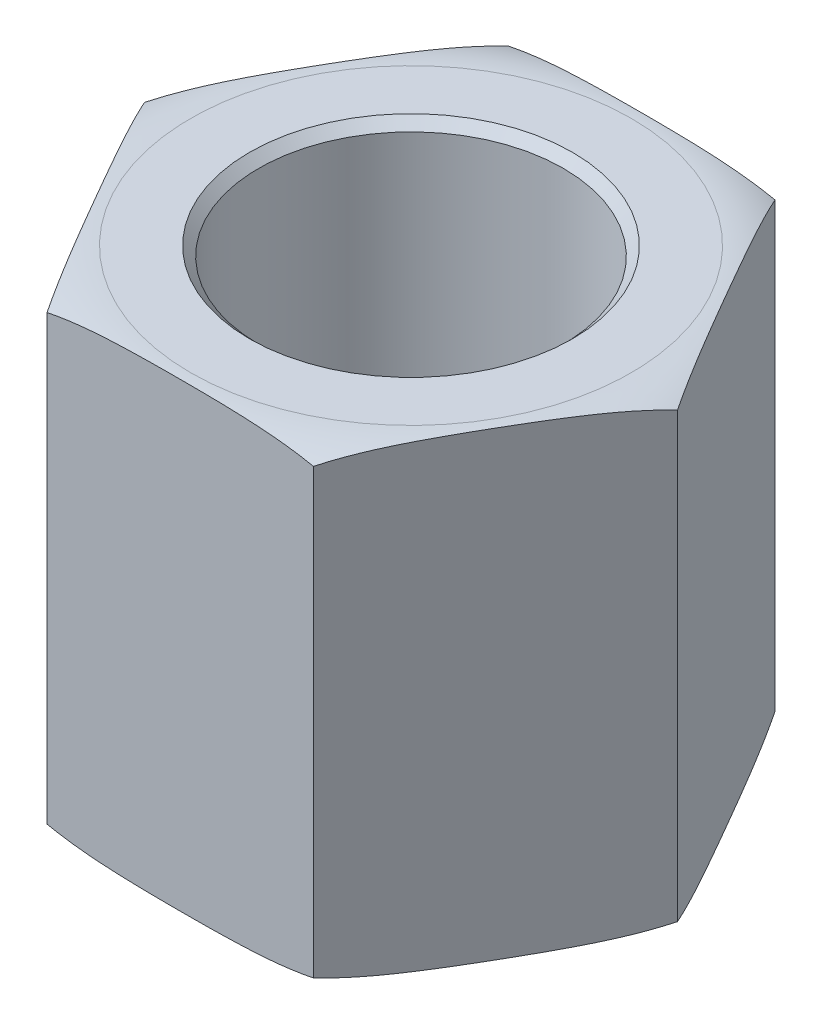
ISO-10303-21;
HEADER;
FILE_DESCRIPTION(('STEP AP214'),'2;1');
FILE_NAME('part.step','',(''),(''),'','','');
FILE_SCHEMA(('AUTOMOTIVE_DESIGN { 1 0 10303 214 1 1 1 1 }'));
ENDSEC;
DATA;
#1=APPLICATION_CONTEXT('core data for automotive mechanical design processes');
#2=APPLICATION_PROTOCOL_DEFINITION('international standard','automotive_design',2000,#1);
#3=PRODUCT_CONTEXT('',#1,'mechanical');
#4=PRODUCT('Part','Part','',(#3));
#5=PRODUCT_RELATED_PRODUCT_CATEGORY('part','',(#4));
#6=PRODUCT_DEFINITION_FORMATION('','',#4);
#7=PRODUCT_DEFINITION_CONTEXT('part definition',#1,'design');
#8=PRODUCT_DEFINITION('design','',#6,#7);
#9=PRODUCT_DEFINITION_SHAPE('','',#8);
#10=(LENGTH_UNIT() NAMED_UNIT(*) SI_UNIT(.MILLI.,.METRE.));
#11=(NAMED_UNIT(*) PLANE_ANGLE_UNIT() SI_UNIT($,.RADIAN.));
#12=(NAMED_UNIT(*) SI_UNIT($,.STERADIAN.) SOLID_ANGLE_UNIT());
#13=UNCERTAINTY_MEASURE_WITH_UNIT(LENGTH_MEASURE(1.E-05),#10,'distance_accuracy_value','');
#14=(GEOMETRIC_REPRESENTATION_CONTEXT(3) GLOBAL_UNCERTAINTY_ASSIGNED_CONTEXT((#13)) GLOBAL_UNIT_ASSIGNED_CONTEXT((#10,
#11,#12)) REPRESENTATION_CONTEXT('',''));
#15=CARTESIAN_POINT('',(0.,0.,0.));
#16=DIRECTION('',(0.,0.,1.));
#17=DIRECTION('',(1.,0.,0.));
#18=AXIS2_PLACEMENT_3D('',#15,#16,#17);
#19=CARTESIAN_POINT('',(3.66617420935412,3.175,0.));
#20=DIRECTION('',(-0.866025403784439,0.,0.5));
#21=DIRECTION('',(0.5,0.,0.866025403784439));
#22=AXIS2_PLACEMENT_3D('',#19,#20,#21);
#23=PLANE('',#22);
#24=DIRECTION('',(0.,1.,0.));
#25=VECTOR('',#24,1.);
#26=CARTESIAN_POINT('',(1.83308710467704,3.175,-3.175));
#27=LINE('',#26,#25);
#28=CARTESIAN_POINT('',(1.83308710467705,-3.048,-3.175));
#29=VERTEX_POINT('',#28);
#30=CARTESIAN_POINT('',(1.83308710467706,3.048,-3.175));
#31=VERTEX_POINT('',#30);
#32=EDGE_CURVE('E300',#29,#31,#27,.T.);
#33=ORIENTED_EDGE('',*,*,#32,.T.);
#34=CARTESIAN_POINT('',(3.66617420935412,3.048,0.));
#35=CARTESIAN_POINT('',(3.62797961467394,3.06390141489968,-0.0661549785605589));
#36=CARTESIAN_POINT('',(3.58956810864156,3.0774886076105,-0.132685658603879));
#37=CARTESIAN_POINT('',(3.5124905179571,3.10081619794021,-0.266187961794368));
#38=CARTESIAN_POINT('',(3.47382473049846,3.11056047713974,-0.333159070187402));
#39=CARTESIAN_POINT('',(3.39641631867872,3.1269966530451,-0.467234372392398));
#40=CARTESIAN_POINT('',(3.35767399633311,3.13369453286691,-0.534338043098204));
#41=CARTESIAN_POINT('',(3.28009834620112,3.1447767572932,-0.668703010557007));
#42=CARTESIAN_POINT('',(3.24126499587769,3.14916045047396,-0.735964346345296));
#43=CARTESIAN_POINT('',(3.16354065964313,3.15624030042628,-0.870586845688132));
#44=CARTESIAN_POINT('',(3.12464965374474,3.15893552375912,-0.937948043861606));
#45=CARTESIAN_POINT('',(3.0468514459459,3.16315319837134,-1.07269849250699));
#46=CARTESIAN_POINT('',(3.00794424351967,3.16467560802717,-1.1400877438896));
#47=CARTESIAN_POINT('',(2.9305151759887,3.16692270588903,-1.27419882283591));
#48=CARTESIAN_POINT('',(2.89199336248931,3.16765524681808,-1.34092056101654));
#49=CARTESIAN_POINT('',(2.8149477834614,3.16857673025741,-1.47436741839145));
#50=CARTESIAN_POINT('',(2.77642401791435,3.1687656658949,-1.54109253761781));
#51=CARTESIAN_POINT('',(2.69935964431008,3.16866599668056,-1.67457194815387));
#52=CARTESIAN_POINT('',(2.66081903631817,3.16837718117656,-1.74132623935046));
#53=CARTESIAN_POINT('',(2.58373908085325,3.167221986219,-1.87483263846085));
#54=CARTESIAN_POINT('',(2.5451997334124,3.16635559703857,-1.94158474631894));
#55=CARTESIAN_POINT('',(2.46812969629766,3.16378619406563,-2.07507396634291));
#56=CARTESIAN_POINT('',(2.4295990062596,3.16208322716165,-2.14181107913951));
#57=CARTESIAN_POINT('',(2.35255651340903,3.1574387229726,-2.27525259109846));
#58=CARTESIAN_POINT('',(2.31404470975437,3.1544972471358,-2.34195699171945));
#59=CARTESIAN_POINT('',(2.25084206239939,3.14821741247488,-2.45142718811113));
#60=CARTESIAN_POINT('',(2.22613849337005,3.14539801104631,-2.49421502479824));
#61=CARTESIAN_POINT('',(2.17676945272223,3.13886967943036,-2.57972471152119));
#62=CARTESIAN_POINT('',(2.15210397034179,3.1351610809139,-2.62244658019731));
#63=CARTESIAN_POINT('',(2.10282753811692,3.12668027114969,-2.7077958644265));
#64=CARTESIAN_POINT('',(2.07821657107525,3.12190846570084,-2.75042330976607));
#65=CARTESIAN_POINT('',(2.02900094683547,3.11109877125159,-2.8356672714756));
#66=CARTESIAN_POINT('',(2.00439646085461,3.10505773130842,-2.87828349128857));
#67=CARTESIAN_POINT('',(1.95527325900931,3.09151383541611,-2.96336737271508));
#68=CARTESIAN_POINT('',(1.93075459617612,3.08401019780296,-3.00583494247581));
#69=CARTESIAN_POINT('',(1.8818215737317,3.06732035070844,-3.09058942351746));
#70=CARTESIAN_POINT('',(1.85740744053269,3.05813149780328,-3.13287594264091));
#71=CARTESIAN_POINT('',(1.83308710467706,3.048,-3.175));
#72=B_SPLINE_CURVE_WITH_KNOTS('',3,(#34,#35,#36,#37,#38,#39,#40,#41,#42,#43,#44,#45,#46,#47,#48,
#49,#50,#51,#52,#53,#54,#55,#56,#57,#58,#59,#60,#61,#62,#63,#64,#65,#66,#67,#68,#69,#70,#71),
.UNSPECIFIED.,.F.,.F.,(4,2,2,2,2,2,2,2,2,2,2,2,2,2,2,2,2,2,4),(0.,0.23397730781795,
0.467717675040711,0.700996973557526,0.934341903229784,1.16781571967244,1.4012978217983,
1.63243665809676,1.86357841666624,2.09482211846302,2.32606971471504,2.55730435147407,
2.78852751694423,2.93698369265096,3.08538458004481,3.2337289233459,3.38244598546617,
3.53124274626086,3.68027493713586),.UNSPECIFIED.);
#73=CARTESIAN_POINT('',(3.66617420935412,3.048,0.));
#74=VERTEX_POINT('',#73);
#75=EDGE_CURVE('E94',#74,#31,#72,.T.);
#76=ORIENTED_EDGE('',*,*,#75,.F.);
#77=DIRECTION('',(0.,1.,0.));
#78=VECTOR('',#77,1.);
#79=CARTESIAN_POINT('',(3.66617420935412,3.175,0.));
#80=LINE('',#79,#78);
#81=CARTESIAN_POINT('',(3.66617420935412,-3.048,0.));
#82=VERTEX_POINT('',#81);
#83=EDGE_CURVE('E297',#74,#82,#80,.F.);
#84=ORIENTED_EDGE('',*,*,#83,.T.);
#85=CARTESIAN_POINT('',(1.83308710467705,-3.048,-3.17500000000001));
#86=CARTESIAN_POINT('',(1.87128169935723,-3.06390141489968,-3.10884502143945));
#87=CARTESIAN_POINT('',(1.9096932053896,-3.0774886076105,-3.04231434139613));
#88=CARTESIAN_POINT('',(1.98677079607407,-3.1008161979402,-2.90881203820564));
#89=CARTESIAN_POINT('',(2.02543658353271,-3.11056047713974,-2.84184092981261));
#90=CARTESIAN_POINT('',(2.10284499535245,-3.12699665304509,-2.70776562760762));
#91=CARTESIAN_POINT('',(2.14158731769805,-3.13369453286691,-2.64066195690181));
#92=CARTESIAN_POINT('',(2.21916296783005,-3.14477675729319,-2.50629698944301));
#93=CARTESIAN_POINT('',(2.25799631815347,-3.14916045047396,-2.43903565365472));
#94=CARTESIAN_POINT('',(2.33572065438803,-3.15624030042628,-2.30441315431189));
#95=CARTESIAN_POINT('',(2.37461166028642,-3.15893552375912,-2.23705195613842));
#96=CARTESIAN_POINT('',(2.45240986808526,-3.16315319837134,-2.10230150749304));
#97=CARTESIAN_POINT('',(2.49131707051149,-3.16467560802717,-2.03491225611043));
#98=CARTESIAN_POINT('',(2.56874613804246,-3.16692270588903,-1.90080117716412));
#99=CARTESIAN_POINT('',(2.60726795154184,-3.16765524681808,-1.83407943898349));
#100=CARTESIAN_POINT('',(2.68431353056976,-3.16857673025742,-1.70063258160858));
#101=CARTESIAN_POINT('',(2.7228372961168,-3.1687656658949,-1.63390746238223));
#102=CARTESIAN_POINT('',(2.79990166972107,-3.16866599668056,-1.50042805184616));
#103=CARTESIAN_POINT('',(2.83844227771298,-3.16837718117656,-1.43367376064958));
#104=CARTESIAN_POINT('',(2.9155222331779,-3.167221986219,-1.30016736153919));
#105=CARTESIAN_POINT('',(2.95406158061874,-3.16635559703857,-1.2334152536811));
#106=CARTESIAN_POINT('',(3.03113161773349,-3.16378619406563,-1.09992603365714));
#107=CARTESIAN_POINT('',(3.06966230777155,-3.16208322716165,-1.03318892086054));
#108=CARTESIAN_POINT('',(3.14670480062212,-3.15743872297261,-0.89974740890159));
#109=CARTESIAN_POINT('',(3.18521660427678,-3.1544972471358,-0.833043008280603));
#110=CARTESIAN_POINT('',(3.24841925163175,-3.14821741247488,-0.723572811888921));
#111=CARTESIAN_POINT('',(3.2731228206611,-3.14539801104632,-0.680784975201808));
#112=CARTESIAN_POINT('',(3.32249186130892,-3.13886967943036,-0.595275288478853));
#113=CARTESIAN_POINT('',(3.34715734368936,-3.1351610809139,-0.552553419802732));
#114=CARTESIAN_POINT('',(3.39643377591423,-3.12668027114969,-0.467204135573528));
#115=CARTESIAN_POINT('',(3.4210447429559,-3.12190846570084,-0.424576690233956));
#116=CARTESIAN_POINT('',(3.47026036719569,-3.11109877125159,-0.339332728524421));
#117=CARTESIAN_POINT('',(3.49486485317655,-3.10505773130842,-0.296716508711452));
#118=CARTESIAN_POINT('',(3.54398805502185,-3.09151383541612,-0.211632627284937));
#119=CARTESIAN_POINT('',(3.56850671785504,-3.08401019780296,-0.169165057524198));
#120=CARTESIAN_POINT('',(3.61743974029947,-3.06732035070844,-0.0844105764825437));
#121=CARTESIAN_POINT('',(3.64185387349848,-3.05813149780329,-0.0421240573590973));
#122=CARTESIAN_POINT('',(3.66617420935412,-3.048,0.));
#123=B_SPLINE_CURVE_WITH_KNOTS('',3,(#85,#86,#87,#88,#89,#90,#91,#92,#93,#94,#95,#96,#97,#98,
#99,#100,#101,#102,#103,#104,#105,#106,#107,#108,#109,#110,#111,#112,#113,#114,#115,#116,#117,
#118,#119,#120,#121,#122),.UNSPECIFIED.,.F.,.F.,(4,2,2,2,2,2,2,2,2,2,2,2,2,2,2,2,2,2,4),(0.,
0.233977307817946,0.467717675040702,0.700996973557513,0.934341903229767,1.16781571967242,
1.40129782179827,1.63243665809673,1.8635784166662,2.09482211846298,2.32606971471499,
2.55730435147402,2.78852751694418,2.93698369265092,3.08538458004477,3.23372892334588,
3.38244598546615,3.53124274626086,3.68027493713586),.UNSPECIFIED.);
#124=EDGE_CURVE('E143',#29,#82,#123,.T.);
#125=ORIENTED_EDGE('',*,*,#124,.F.);
#126=EDGE_LOOP('',(#33,#76,#84,#125));
#127=FACE_BOUND('',#126,.T.);
#128=ADVANCED_FACE('F14',(#127),#23,.F.);
#129=CARTESIAN_POINT('',(1.83308710467706,3.175,3.17499999999999));
#130=DIRECTION('',(-0.866025403784439,0.,-0.5));
#131=DIRECTION('',(-0.5,0.,0.866025403784439));
#132=AXIS2_PLACEMENT_3D('',#129,#130,#131);
#133=PLANE('',#132);
#134=ORIENTED_EDGE('',*,*,#83,.F.);
#135=CARTESIAN_POINT('',(1.83308710467706,3.048,3.17499999999999));
#136=CARTESIAN_POINT('',(1.87128169935724,3.06390141489968,3.10884502143943));
#137=CARTESIAN_POINT('',(1.90969320538962,3.0774886076105,3.04231434139611));
#138=CARTESIAN_POINT('',(1.98677079607408,3.10081619794021,2.90881203820562));
#139=CARTESIAN_POINT('',(2.02543658353273,3.11056047713974,2.84184092981259));
#140=CARTESIAN_POINT('',(2.10284499535246,3.1269966530451,2.70776562760759));
#141=CARTESIAN_POINT('',(2.14158731769807,3.13369453286691,2.64066195690179));
#142=CARTESIAN_POINT('',(2.21916296783006,3.1447767572932,2.50629698944298));
#143=CARTESIAN_POINT('',(2.25799631815349,3.14916045047396,2.43903565365469));
#144=CARTESIAN_POINT('',(2.33572065438805,3.15624030042628,2.30441315431186));
#145=CARTESIAN_POINT('',(2.37461166028644,3.15893552375912,2.23705195613839));
#146=CARTESIAN_POINT('',(2.45240986808528,3.16315319837134,2.102301507493));
#147=CARTESIAN_POINT('',(2.49131707051152,3.16467560802717,2.03491225611039));
#148=CARTESIAN_POINT('',(2.56874613804248,3.16692270588903,1.90080117716408));
#149=CARTESIAN_POINT('',(2.60726795154187,3.16765524681808,1.83407943898345));
#150=CARTESIAN_POINT('',(2.68431353056978,3.16857673025741,1.70063258160854));
#151=CARTESIAN_POINT('',(2.72283729611683,3.1687656658949,1.63390746238219));
#152=CARTESIAN_POINT('',(2.7999016697211,3.16866599668056,1.50042805184612));
#153=CARTESIAN_POINT('',(2.83844227771301,3.16837718117656,1.43367376064953));
#154=CARTESIAN_POINT('',(2.91552223317793,3.167221986219,1.30016736153914));
#155=CARTESIAN_POINT('',(2.95406158061878,3.16635559703857,1.23341525368105));
#156=CARTESIAN_POINT('',(3.03113161773353,3.16378619406563,1.09992603365708));
#157=CARTESIAN_POINT('',(3.06966230777158,3.16208322716165,1.03318892086048));
#158=CARTESIAN_POINT('',(3.14670480062215,3.1574387229726,0.899747408901533));
#159=CARTESIAN_POINT('',(3.18521660427681,3.1544972471358,0.833043008280545));
#160=CARTESIAN_POINT('',(3.24841925163179,3.14821741247488,0.723572811888865));
#161=CARTESIAN_POINT('',(3.27312282066113,3.14539801104631,0.680784975201756));
#162=CARTESIAN_POINT('',(3.32249186130895,3.13886967943036,0.595275288478808));
#163=CARTESIAN_POINT('',(3.34715734368939,3.1351610809139,0.55255341980269));
#164=CARTESIAN_POINT('',(3.39643377591426,3.12668027114969,0.467204135573494));
#165=CARTESIAN_POINT('',(3.42104474295592,3.12190846570084,0.424576690233925));
#166=CARTESIAN_POINT('',(3.47026036719571,3.11109877125159,0.339332728524397));
#167=CARTESIAN_POINT('',(3.49486485317657,3.10505773130842,0.296716508711432));
#168=CARTESIAN_POINT('',(3.54398805502186,3.09151383541612,0.211632627284924));
#169=CARTESIAN_POINT('',(3.56850671785505,3.08401019780296,0.169165057524189));
#170=CARTESIAN_POINT('',(3.61743974029947,3.06732035070844,0.0844105764825421));
#171=CARTESIAN_POINT('',(3.64185387349848,3.05813149780328,0.0421240573590994));
#172=CARTESIAN_POINT('',(3.66617420935412,3.048,0.));
#173=B_SPLINE_CURVE_WITH_KNOTS('',3,(#135,#136,#137,#138,#139,#140,#141,#142,#143,#144,#145,
#146,#147,#148,#149,#150,#151,#152,#153,#154,#155,#156,#157,#158,#159,#160,#161,#162,#163,#164,
#165,#166,#167,#168,#169,#170,#171,#172),.UNSPECIFIED.,.F.,.F.,(4,2,2,2,2,2,2,2,2,2,2,2,2,2,2,2,
2,2,4),(0.,0.23397730781795,0.467717675040712,0.700996973557526,0.934341903229785,
1.16781571967244,1.4012978217983,1.63243665809676,1.86357841666624,2.09482211846302,
2.32606971471504,2.55730435147407,2.78852751694424,2.93698369265096,3.0853845800448,
3.23372892334589,3.38244598546615,3.53124274626085,3.68027493713584),.UNSPECIFIED.);
#174=CARTESIAN_POINT('',(1.83308710467706,3.048,3.17499999999999));
#175=VERTEX_POINT('',#174);
#176=EDGE_CURVE('E171',#175,#74,#173,.T.);
#177=ORIENTED_EDGE('',*,*,#176,.F.);
#178=DIRECTION('',(0.,1.,0.));
#179=VECTOR('',#178,1.);
#180=CARTESIAN_POINT('',(1.83308710467706,3.175,3.17499999999999));
#181=LINE('',#180,#179);
#182=CARTESIAN_POINT('',(1.83308710467706,-3.048,3.17499999999999));
#183=VERTEX_POINT('',#182);
#184=EDGE_CURVE('E295',#175,#183,#181,.F.);
#185=ORIENTED_EDGE('',*,*,#184,.T.);
#186=CARTESIAN_POINT('',(3.66617420935412,-3.048,0.));
#187=CARTESIAN_POINT('',(3.62797961467394,-3.06390141489968,0.0661549785605642));
#188=CARTESIAN_POINT('',(3.58956810864156,-3.0774886076105,0.132685658603884));
#189=CARTESIAN_POINT('',(3.5124905179571,-3.10081619794021,0.266187961794373));
#190=CARTESIAN_POINT('',(3.47382473049845,-3.11056047713974,0.333159070187407));
#191=CARTESIAN_POINT('',(3.39641631867872,-3.1269966530451,0.467234372392404));
#192=CARTESIAN_POINT('',(3.35767399633311,-3.13369453286691,0.53433804309821));
#193=CARTESIAN_POINT('',(3.28009834620112,-3.1447767572932,0.668703010557013));
#194=CARTESIAN_POINT('',(3.24126499587769,-3.14916045047396,0.735964346345303));
#195=CARTESIAN_POINT('',(3.16354065964313,-3.15624030042628,0.870586845688138));
#196=CARTESIAN_POINT('',(3.12464965374474,-3.15893552375912,0.937948043861613));
#197=CARTESIAN_POINT('',(3.0468514459459,-3.16315319837134,1.07269849250699));
#198=CARTESIAN_POINT('',(3.00794424351966,-3.16467560802717,1.1400877438896));
#199=CARTESIAN_POINT('',(2.9305151759887,-3.16692270588903,1.27419882283592));
#200=CARTESIAN_POINT('',(2.89199336248931,-3.16765524681808,1.34092056101655));
#201=CARTESIAN_POINT('',(2.8149477834614,-3.16857673025741,1.47436741839146));
#202=CARTESIAN_POINT('',(2.77642401791435,-3.1687656658949,1.54109253761781));
#203=CARTESIAN_POINT('',(2.69935964431008,-3.16866599668056,1.67457194815388));
#204=CARTESIAN_POINT('',(2.66081903631817,-3.16837718117656,1.74132623935047));
#205=CARTESIAN_POINT('',(2.58373908085325,-3.167221986219,1.87483263846085));
#206=CARTESIAN_POINT('',(2.5451997334124,-3.16635559703857,1.94158474631895));
#207=CARTESIAN_POINT('',(2.46812969629765,-3.16378619406563,2.07507396634292));
#208=CARTESIAN_POINT('',(2.4295990062596,-3.16208322716165,2.14181107913952));
#209=CARTESIAN_POINT('',(2.35255651340903,-3.1574387229726,2.27525259109847));
#210=CARTESIAN_POINT('',(2.31404470975437,-3.1544972471358,2.34195699171945));
#211=CARTESIAN_POINT('',(2.25084206239939,-3.14821741247488,2.45142718811113));
#212=CARTESIAN_POINT('',(2.22613849337005,-3.14539801104631,2.49421502479824));
#213=CARTESIAN_POINT('',(2.17676945272223,-3.13886967943036,2.57972471152119));
#214=CARTESIAN_POINT('',(2.15210397034179,-3.1351610809139,2.62244658019731));
#215=CARTESIAN_POINT('',(2.10282753811692,-3.12668027114969,2.7077958644265));
#216=CARTESIAN_POINT('',(2.07821657107526,-3.12190846570084,2.75042330976607));
#217=CARTESIAN_POINT('',(2.02900094683547,-3.11109877125159,2.8356672714756));
#218=CARTESIAN_POINT('',(2.00439646085461,-3.10505773130842,2.87828349128856));
#219=CARTESIAN_POINT('',(1.95527325900932,-3.09151383541611,2.96336737271507));
#220=CARTESIAN_POINT('',(1.93075459617613,-3.08401019780296,3.00583494247581));
#221=CARTESIAN_POINT('',(1.88182157373171,-3.06732035070844,3.09058942351745));
#222=CARTESIAN_POINT('',(1.8574074405327,-3.05813149780328,3.1328759426409));
#223=CARTESIAN_POINT('',(1.83308710467706,-3.048,3.17499999999999));
#224=B_SPLINE_CURVE_WITH_KNOTS('',3,(#186,#187,#188,#189,#190,#191,#192,#193,#194,#195,#196,
#197,#198,#199,#200,#201,#202,#203,#204,#205,#206,#207,#208,#209,#210,#211,#212,#213,#214,#215,
#216,#217,#218,#219,#220,#221,#222,#223),.UNSPECIFIED.,.F.,.F.,(4,2,2,2,2,2,2,2,2,2,2,2,2,2,2,2,
2,2,4),(0.,0.23397730781795,0.467717675040712,0.700996973557527,0.934341903229786,
1.16781571967244,1.4012978217983,1.63243665809676,1.86357841666624,2.09482211846302,
2.32606971471504,2.55730435147408,2.78852751694424,2.93698369265096,3.0853845800448,
3.23372892334589,3.38244598546615,3.53124274626085,3.68027493713584),.UNSPECIFIED.);
#225=EDGE_CURVE('E150',#82,#183,#224,.T.);
#226=ORIENTED_EDGE('',*,*,#225,.F.);
#227=EDGE_LOOP('',(#134,#177,#185,#226));
#228=FACE_BOUND('',#227,.T.);
#229=ADVANCED_FACE('F162',(#228),#133,.F.);
#230=CARTESIAN_POINT('',(1.83308710467706,3.175,-3.175));
#231=DIRECTION('',(0.,0.,1.));
#232=DIRECTION('',(1.,0.,0.));
#233=AXIS2_PLACEMENT_3D('',#230,#231,#232);
#234=PLANE('',#233);
#235=DIRECTION('',(0.,1.,0.));
#236=VECTOR('',#235,1.);
#237=CARTESIAN_POINT('',(-1.83308710467707,3.175,-3.175));
#238=LINE('',#237,#236);
#239=CARTESIAN_POINT('',(-1.83308710467707,-3.048,-3.175));
#240=VERTEX_POINT('',#239);
#241=CARTESIAN_POINT('',(-1.83308710467706,3.048,-3.17500000000001));
#242=VERTEX_POINT('',#241);
#243=EDGE_CURVE('E101',#240,#242,#238,.T.);
#244=ORIENTED_EDGE('',*,*,#243,.T.);
#245=CARTESIAN_POINT('',(1.83308710467705,3.048,-3.175));
#246=CARTESIAN_POINT('',(1.73237579828683,3.06894001415179,-3.175));
#247=CARTESIAN_POINT('',(1.63096506893486,3.08588534953273,-3.175));
#248=CARTESIAN_POINT('',(1.42767146651469,3.11349716439842,-3.175));
#249=CARTESIAN_POINT('',(1.32579191427254,3.12418756587531,-3.175));
#250=CARTESIAN_POINT('',(1.12177634709137,3.14112804080793,-3.175));
#251=CARTESIAN_POINT('',(1.01964056643379,3.14738127071887,-3.175));
#252=CARTESIAN_POINT('',(0.815663681397375,3.15690280641833,-3.175));
#253=CARTESIAN_POINT('',(0.713823115514572,3.1601834044999,-3.175));
#254=CARTESIAN_POINT('',(0.51001848544165,3.16494548487028,-3.175));
#255=CARTESIAN_POINT('',(0.408054390577976,3.16642541008817,-3.175));
#256=CARTESIAN_POINT('',(0.20406020033787,3.16831468183792,-3.175));
#257=CARTESIAN_POINT('',(0.102030100168935,3.16872342414921,-3.175));
#258=CARTESIAN_POINT('',(-0.102030100168934,3.16872342414921,-3.175));
#259=CARTESIAN_POINT('',(-0.204060200337869,3.16831468183792,-3.175));
#260=CARTESIAN_POINT('',(-0.408054390577974,3.16642541008817,-3.175));
#261=CARTESIAN_POINT('',(-0.510018485441648,3.16494548487028,-3.175));
#262=CARTESIAN_POINT('',(-0.71382311551457,3.1601834044999,-3.175));
#263=CARTESIAN_POINT('',(-0.815663681397372,3.15690280641833,-3.175));
#264=CARTESIAN_POINT('',(-1.01964056643379,3.14738127071887,-3.175));
#265=CARTESIAN_POINT('',(-1.12177634709137,3.14112804080793,-3.175));
#266=CARTESIAN_POINT('',(-1.32579191427253,3.12418756587531,-3.175));
#267=CARTESIAN_POINT('',(-1.42767146651468,3.11349716439842,-3.175));
#268=CARTESIAN_POINT('',(-1.63096506893485,3.08588534953273,-3.175));
#269=CARTESIAN_POINT('',(-1.73237579828682,3.06894001415179,-3.175));
#270=CARTESIAN_POINT('',(-1.83308710467705,3.048,-3.175));
#271=B_SPLINE_CURVE_WITH_KNOTS('',3,(#245,#246,#247,#248,#249,#250,#251,#252,#253,#254,#255,
#256,#257,#258,#259,#260,#261,#262,#263,#264,#265,#266,#267,#268,#269,#270),.UNSPECIFIED.,.F.,
.F.,(4,2,2,2,2,2,2,2,2,2,2,2,4),(0.,0.308333242342807,0.615479423308234,0.922406891130007,
1.2280592962085,1.53397581645216,1.84006485747888,2.14615389850561,2.45207041874927,
2.75772282382776,3.06465029164953,3.37179647261496,3.68012971495776),.UNSPECIFIED.);
#272=EDGE_CURVE('E86',#31,#242,#271,.T.);
#273=ORIENTED_EDGE('',*,*,#272,.F.);
#274=ORIENTED_EDGE('',*,*,#32,.F.);
#275=CARTESIAN_POINT('',(-1.83308710467707,-3.048,-3.175));
#276=CARTESIAN_POINT('',(-1.73237579828684,-3.06894001415179,-3.175));
#277=CARTESIAN_POINT('',(-1.63096506893487,-3.08588534953273,-3.175));
#278=CARTESIAN_POINT('',(-1.4276714665147,-3.11349716439842,-3.175));
#279=CARTESIAN_POINT('',(-1.32579191427255,-3.12418756587531,-3.175));
#280=CARTESIAN_POINT('',(-1.12177634709138,-3.14112804080793,-3.175));
#281=CARTESIAN_POINT('',(-1.0196405664338,-3.14738127071887,-3.175));
#282=CARTESIAN_POINT('',(-0.81566368139738,-3.15690280641833,-3.175));
#283=CARTESIAN_POINT('',(-0.713823115514576,-3.1601834044999,-3.175));
#284=CARTESIAN_POINT('',(-0.510018485441653,-3.16494548487028,-3.175));
#285=CARTESIAN_POINT('',(-0.408054390577979,-3.16642541008817,-3.175));
#286=CARTESIAN_POINT('',(-0.204060200337872,-3.16831468183792,-3.175));
#287=CARTESIAN_POINT('',(-0.102030100168936,-3.16872342414921,-3.175));
#288=CARTESIAN_POINT('',(0.102030100168934,-3.16872342414921,-3.175));
#289=CARTESIAN_POINT('',(0.204060200337869,-3.16831468183792,-3.175));
#290=CARTESIAN_POINT('',(0.408054390577974,-3.16642541008817,-3.175));
#291=CARTESIAN_POINT('',(0.510018485441648,-3.16494548487028,-3.175));
#292=CARTESIAN_POINT('',(0.713823115514568,-3.1601834044999,-3.175));
#293=CARTESIAN_POINT('',(0.81566368139737,-3.15690280641833,-3.175));
#294=CARTESIAN_POINT('',(1.01964056643379,-3.14738127071887,-3.175));
#295=CARTESIAN_POINT('',(1.12177634709137,-3.14112804080793,-3.175));
#296=CARTESIAN_POINT('',(1.32579191427253,-3.12418756587531,-3.175));
#297=CARTESIAN_POINT('',(1.42767146651468,-3.11349716439842,-3.175));
#298=CARTESIAN_POINT('',(1.63096506893485,-3.08588534953273,-3.175));
#299=CARTESIAN_POINT('',(1.73237579828682,-3.06894001415179,-3.175));
#300=CARTESIAN_POINT('',(1.83308710467705,-3.048,-3.175));
#301=B_SPLINE_CURVE_WITH_KNOTS('',3,(#275,#276,#277,#278,#279,#280,#281,#282,#283,#284,#285,
#286,#287,#288,#289,#290,#291,#292,#293,#294,#295,#296,#297,#298,#299,#300),.UNSPECIFIED.,.F.,
.F.,(4,2,2,2,2,2,2,2,2,2,2,2,4),(0.,0.308333242342809,0.615479423308237,0.922406891130013,
1.22805929620851,1.53397581645217,1.8400648574789,2.14615389850562,2.45207041874928,
2.75772282382777,3.06465029164954,3.37179647261497,3.68012971495777),.UNSPECIFIED.);
#302=EDGE_CURVE('E103',#240,#29,#301,.T.);
#303=ORIENTED_EDGE('',*,*,#302,.F.);
#304=EDGE_LOOP('',(#244,#273,#274,#303));
#305=FACE_BOUND('',#304,.T.);
#306=ADVANCED_FACE('F102',(#305),#234,.F.);
#307=CARTESIAN_POINT('',(-1.83308710467707,3.175,3.175));
#308=DIRECTION('',(0.,0.,-1.));
#309=DIRECTION('',(-1.,0.,0.));
#310=AXIS2_PLACEMENT_3D('',#307,#308,#309);
#311=PLANE('',#310);
#312=ORIENTED_EDGE('',*,*,#184,.F.);
#313=CARTESIAN_POINT('',(-1.83308710467706,3.048,3.175));
#314=CARTESIAN_POINT('',(-1.73237579828684,3.06894001415179,3.175));
#315=CARTESIAN_POINT('',(-1.63096506893486,3.08588534953273,3.175));
#316=CARTESIAN_POINT('',(-1.42767146651469,3.11349716439842,3.175));
#317=CARTESIAN_POINT('',(-1.32579191427254,3.12418756587531,3.175));
#318=CARTESIAN_POINT('',(-1.12177634709138,3.14112804080793,3.175));
#319=CARTESIAN_POINT('',(-1.0196405664338,3.14738127071887,3.175));
#320=CARTESIAN_POINT('',(-0.815663681397378,3.15690280641833,3.175));
#321=CARTESIAN_POINT('',(-0.713823115514575,3.1601834044999,3.175));
#322=CARTESIAN_POINT('',(-0.510018485441652,3.16494548487028,3.175));
#323=CARTESIAN_POINT('',(-0.408054390577977,3.16642541008817,3.175));
#324=CARTESIAN_POINT('',(-0.204060200337871,3.16831468183792,3.175));
#325=CARTESIAN_POINT('',(-0.102030100168935,3.16872342414921,3.175));
#326=CARTESIAN_POINT('',(0.102030100168935,3.16872342414921,3.175));
#327=CARTESIAN_POINT('',(0.204060200337871,3.16831468183792,3.17499999999999));
#328=CARTESIAN_POINT('',(0.408054390577978,3.16642541008817,3.17499999999999));
#329=CARTESIAN_POINT('',(0.510018485441653,3.16494548487028,3.17499999999999));
#330=CARTESIAN_POINT('',(0.713823115514575,3.1601834044999,3.17499999999999));
#331=CARTESIAN_POINT('',(0.815663681397378,3.15690280641833,3.17499999999999));
#332=CARTESIAN_POINT('',(1.0196405664338,3.14738127071887,3.17499999999999));
#333=CARTESIAN_POINT('',(1.12177634709138,3.14112804080793,3.17499999999999));
#334=CARTESIAN_POINT('',(1.32579191427254,3.12418756587531,3.17499999999999));
#335=CARTESIAN_POINT('',(1.4276714665147,3.11349716439842,3.17499999999999));
#336=CARTESIAN_POINT('',(1.63096506893486,3.08588534953273,3.17499999999999));
#337=CARTESIAN_POINT('',(1.73237579828684,3.06894001415179,3.17499999999999));
#338=CARTESIAN_POINT('',(1.83308710467706,3.048,3.17499999999999));
#339=B_SPLINE_CURVE_WITH_KNOTS('',3,(#313,#314,#315,#316,#317,#318,#319,#320,#321,#322,#323,
#324,#325,#326,#327,#328,#329,#330,#331,#332,#333,#334,#335,#336,#337,#338),.UNSPECIFIED.,.F.,
.F.,(4,2,2,2,2,2,2,2,2,2,2,2,4),(0.,0.308333242342808,0.615479423308236,0.922406891130011,
1.2280592962085,1.53397581645216,1.84006485747889,2.14615389850562,2.45207041874928,
2.75772282382777,3.06465029164955,3.37179647261498,3.68012971495778),.UNSPECIFIED.);
#340=CARTESIAN_POINT('',(-1.83308710467707,3.048,3.175));
#341=VERTEX_POINT('',#340);
#342=EDGE_CURVE('E97',#341,#175,#339,.T.);
#343=ORIENTED_EDGE('',*,*,#342,.F.);
#344=DIRECTION('',(0.,1.,0.));
#345=VECTOR('',#344,1.);
#346=CARTESIAN_POINT('',(-1.83308710467707,3.175,3.175));
#347=LINE('',#346,#345);
#348=CARTESIAN_POINT('',(-1.83308710467706,-3.048,3.175));
#349=VERTEX_POINT('',#348);
#350=EDGE_CURVE('E105',#341,#349,#347,.F.);
#351=ORIENTED_EDGE('',*,*,#350,.T.);
#352=CARTESIAN_POINT('',(1.83308710467706,-3.048,3.17499999999999));
#353=CARTESIAN_POINT('',(1.73237579828684,-3.06894001415179,3.17499999999999));
#354=CARTESIAN_POINT('',(1.63096506893486,-3.08588534953273,3.17499999999999));
#355=CARTESIAN_POINT('',(1.4276714665147,-3.11349716439842,3.17499999999999));
#356=CARTESIAN_POINT('',(1.32579191427254,-3.12418756587531,3.17499999999999));
#357=CARTESIAN_POINT('',(1.12177634709138,-3.14112804080793,3.17499999999999));
#358=CARTESIAN_POINT('',(1.0196405664338,-3.14738127071887,3.17499999999999));
#359=CARTESIAN_POINT('',(0.815663681397379,-3.15690280641833,3.17499999999999));
#360=CARTESIAN_POINT('',(0.713823115514576,-3.1601834044999,3.17499999999999));
#361=CARTESIAN_POINT('',(0.510018485441653,-3.16494548487028,3.17499999999999));
#362=CARTESIAN_POINT('',(0.408054390577978,-3.16642541008817,3.17499999999999));
#363=CARTESIAN_POINT('',(0.204060200337871,-3.16831468183792,3.17499999999999));
#364=CARTESIAN_POINT('',(0.102030100168935,-3.16872342414921,3.175));
#365=CARTESIAN_POINT('',(-0.102030100168935,-3.16872342414921,3.175));
#366=CARTESIAN_POINT('',(-0.204060200337871,-3.16831468183792,3.175));
#367=CARTESIAN_POINT('',(-0.408054390577977,-3.16642541008817,3.175));
#368=CARTESIAN_POINT('',(-0.510018485441652,-3.16494548487028,3.175));
#369=CARTESIAN_POINT('',(-0.713823115514574,-3.1601834044999,3.175));
#370=CARTESIAN_POINT('',(-0.815663681397377,-3.15690280641833,3.175));
#371=CARTESIAN_POINT('',(-1.0196405664338,-3.14738127071887,3.175));
#372=CARTESIAN_POINT('',(-1.12177634709138,-3.14112804080793,3.175));
#373=CARTESIAN_POINT('',(-1.32579191427254,-3.12418756587531,3.175));
#374=CARTESIAN_POINT('',(-1.42767146651469,-3.11349716439842,3.175));
#375=CARTESIAN_POINT('',(-1.63096506893486,-3.08588534953273,3.175));
#376=CARTESIAN_POINT('',(-1.73237579828683,-3.06894001415179,3.175));
#377=CARTESIAN_POINT('',(-1.83308710467706,-3.048,3.175));
#378=B_SPLINE_CURVE_WITH_KNOTS('',3,(#352,#353,#354,#355,#356,#357,#358,#359,#360,#361,#362,
#363,#364,#365,#366,#367,#368,#369,#370,#371,#372,#373,#374,#375,#376,#377),.UNSPECIFIED.,.F.,
.F.,(4,2,2,2,2,2,2,2,2,2,2,2,4),(0.,0.308333242342808,0.615479423308237,0.922406891130012,
1.22805929620851,1.53397581645217,1.84006485747889,2.14615389850562,2.45207041874928,
2.75772282382777,3.06465029164955,3.37179647261498,3.68012971495778),.UNSPECIFIED.);
#379=EDGE_CURVE('E193',#183,#349,#378,.T.);
#380=ORIENTED_EDGE('',*,*,#379,.F.);
#381=EDGE_LOOP('',(#312,#343,#351,#380));
#382=FACE_BOUND('',#381,.T.);
#383=ADVANCED_FACE('F186',(#382),#311,.F.);
#384=CARTESIAN_POINT('',(-3.66617420935413,3.175,0.));
#385=DIRECTION('',(0.866025403784439,0.,-0.499999999999999));
#386=DIRECTION('',(-0.499999999999999,0.,-0.866025403784439));
#387=AXIS2_PLACEMENT_3D('',#384,#385,#386);
#388=PLANE('',#387);
#389=ORIENTED_EDGE('',*,*,#350,.F.);
#390=CARTESIAN_POINT('',(-3.66617420935412,3.048,0.));
#391=CARTESIAN_POINT('',(-3.62797961467395,3.06390141489968,0.0661549785605643));
#392=CARTESIAN_POINT('',(-3.58956810864157,3.0774886076105,0.132685658603883));
#393=CARTESIAN_POINT('',(-3.51249051795711,3.10081619794021,0.266187961794372));
#394=CARTESIAN_POINT('',(-3.47382473049846,3.11056047713974,0.333159070187405));
#395=CARTESIAN_POINT('',(-3.39641631867873,3.12699665304509,0.467234372392402));
#396=CARTESIAN_POINT('',(-3.35767399633312,3.13369453286691,0.534338043098207));
#397=CARTESIAN_POINT('',(-3.28009834620112,3.14477675729319,0.66870301055701));
#398=CARTESIAN_POINT('',(-3.2412649958777,3.14916045047396,0.735964346345299));
#399=CARTESIAN_POINT('',(-3.16354065964313,3.15624030042628,0.870586845688135));
#400=CARTESIAN_POINT('',(-3.12464965374474,3.15893552375912,0.937948043861609));
#401=CARTESIAN_POINT('',(-3.04685144594591,3.16315319837134,1.07269849250699));
#402=CARTESIAN_POINT('',(-3.00794424351967,3.16467560802717,1.1400877438896));
#403=CARTESIAN_POINT('',(-2.93051517598871,3.16692270588903,1.27419882283591));
#404=CARTESIAN_POINT('',(-2.89199336248932,3.16765524681808,1.34092056101655));
#405=CARTESIAN_POINT('',(-2.81494778346141,3.16857673025741,1.47436741839145));
#406=CARTESIAN_POINT('',(-2.77642401791436,3.1687656658949,1.54109253761781));
#407=CARTESIAN_POINT('',(-2.69935964431009,3.16866599668056,1.67457194815387));
#408=CARTESIAN_POINT('',(-2.66081903631818,3.16837718117655,1.74132623935046));
#409=CARTESIAN_POINT('',(-2.58373908085326,3.16722198621899,1.87483263846085));
#410=CARTESIAN_POINT('',(-2.54519973341241,3.16635559703857,1.94158474631894));
#411=CARTESIAN_POINT('',(-2.46812969629767,3.16378619406563,2.07507396634291));
#412=CARTESIAN_POINT('',(-2.42959900625961,3.16208322716165,2.14181107913951));
#413=CARTESIAN_POINT('',(-2.35255651340904,3.1574387229726,2.27525259109846));
#414=CARTESIAN_POINT('',(-2.31404470975438,3.1544972471358,2.34195699171945));
#415=CARTESIAN_POINT('',(-2.2508420623994,3.14821741247488,2.45142718811113));
#416=CARTESIAN_POINT('',(-2.22613849337006,3.14539801104631,2.49421502479824));
#417=CARTESIAN_POINT('',(-2.17676945272224,3.13886967943036,2.57972471152118));
#418=CARTESIAN_POINT('',(-2.1521039703418,3.1351610809139,2.6224465801973));
#419=CARTESIAN_POINT('',(-2.10282753811693,3.12668027114968,2.7077958644265));
#420=CARTESIAN_POINT('',(-2.07821657107527,3.12190846570084,2.75042330976607));
#421=CARTESIAN_POINT('',(-2.02900094683548,3.11109877125159,2.8356672714756));
#422=CARTESIAN_POINT('',(-2.00439646085462,3.10505773130841,2.87828349128857));
#423=CARTESIAN_POINT('',(-1.95527325900933,3.09151383541611,2.96336737271508));
#424=CARTESIAN_POINT('',(-1.93075459617614,3.08401019780296,3.00583494247581));
#425=CARTESIAN_POINT('',(-1.88182157373171,3.06732035070844,3.09058942351746));
#426=CARTESIAN_POINT('',(-1.8574074405327,3.05813149780328,3.1328759426409));
#427=CARTESIAN_POINT('',(-1.83308710467707,3.048,3.175));
#428=B_SPLINE_CURVE_WITH_KNOTS('',3,(#390,#391,#392,#393,#394,#395,#396,#397,#398,#399,#400,
#401,#402,#403,#404,#405,#406,#407,#408,#409,#410,#411,#412,#413,#414,#415,#416,#417,#418,#419,
#420,#421,#422,#423,#424,#425,#426,#427),.UNSPECIFIED.,.F.,.F.,(4,2,2,2,2,2,2,2,2,2,2,2,2,2,2,2,
2,2,4),(0.,0.233977307817949,0.46771767504071,0.700996973557524,0.934341903229782,
1.16781571967244,1.40129782179829,1.63243665809675,1.86357841666623,2.09482211846301,
2.32606971471503,2.55730435147406,2.78852751694422,2.93698369265095,3.0853845800448,
3.23372892334589,3.38244598546616,3.53124274626085,3.68027493713584),.UNSPECIFIED.);
#429=CARTESIAN_POINT('',(-3.66617420935413,3.048,0.));
#430=VERTEX_POINT('',#429);
#431=EDGE_CURVE('E98',#430,#341,#428,.T.);
#432=ORIENTED_EDGE('',*,*,#431,.F.);
#433=DIRECTION('',(0.,1.,0.));
#434=VECTOR('',#433,1.);
#435=CARTESIAN_POINT('',(-3.66617420935413,3.175,0.));
#436=LINE('',#435,#434);
#437=CARTESIAN_POINT('',(-3.66617420935412,-3.048,0.));
#438=VERTEX_POINT('',#437);
#439=EDGE_CURVE('E80',#430,#438,#436,.F.);
#440=ORIENTED_EDGE('',*,*,#439,.T.);
#441=CARTESIAN_POINT('',(-1.83308710467707,-3.048,3.175));
#442=CARTESIAN_POINT('',(-1.87128169935724,-3.06390141489968,3.10884502143944));
#443=CARTESIAN_POINT('',(-1.90969320538962,-3.0774886076105,3.04231434139612));
#444=CARTESIAN_POINT('',(-1.98677079607408,-3.1008161979402,2.90881203820564));
#445=CARTESIAN_POINT('',(-2.02543658353273,-3.11056047713974,2.8418409298126));
#446=CARTESIAN_POINT('',(-2.10284499535246,-3.12699665304509,2.70776562760761));
#447=CARTESIAN_POINT('',(-2.14158731769807,-3.13369453286691,2.6406619569018));
#448=CARTESIAN_POINT('',(-2.21916296783006,-3.14477675729319,2.506296989443));
#449=CARTESIAN_POINT('',(-2.25799631815348,-3.14916045047396,2.43903565365471));
#450=CARTESIAN_POINT('',(-2.33572065438805,-3.15624030042628,2.30441315431188));
#451=CARTESIAN_POINT('',(-2.37461166028644,-3.15893552375912,2.23705195613841));
#452=CARTESIAN_POINT('',(-2.45240986808527,-3.16315319837134,2.10230150749303));
#453=CARTESIAN_POINT('',(-2.49131707051151,-3.16467560802717,2.03491225611042));
#454=CARTESIAN_POINT('',(-2.56874613804247,-3.16692270588903,1.90080117716411));
#455=CARTESIAN_POINT('',(-2.60726795154186,-3.16765524681808,1.83407943898347));
#456=CARTESIAN_POINT('',(-2.68431353056977,-3.16857673025741,1.70063258160857));
#457=CARTESIAN_POINT('',(-2.72283729611682,-3.1687656658949,1.63390746238222));
#458=CARTESIAN_POINT('',(-2.79990166972109,-3.16866599668056,1.50042805184615));
#459=CARTESIAN_POINT('',(-2.838442277713,-3.16837718117656,1.43367376064956));
#460=CARTESIAN_POINT('',(-2.91552223317792,-3.167221986219,1.30016736153918));
#461=CARTESIAN_POINT('',(-2.95406158061876,-3.16635559703857,1.23341525368108));
#462=CARTESIAN_POINT('',(-3.03113161773351,-3.16378619406563,1.09992603365712));
#463=CARTESIAN_POINT('',(-3.06966230777157,-3.16208322716165,1.03318892086052));
#464=CARTESIAN_POINT('',(-3.14670480062213,-3.1574387229726,0.899747408901574));
#465=CARTESIAN_POINT('',(-3.18521660427679,-3.1544972471358,0.833043008280587));
#466=CARTESIAN_POINT('',(-3.24841925163177,-3.14821741247488,0.723572811888905));
#467=CARTESIAN_POINT('',(-3.27312282066112,-3.14539801104632,0.680784975201794));
#468=CARTESIAN_POINT('',(-3.32249186130893,-3.13886967943036,0.595275288478841));
#469=CARTESIAN_POINT('',(-3.34715734368937,-3.1351610809139,0.552553419802721));
#470=CARTESIAN_POINT('',(-3.39643377591425,-3.12668027114969,0.467204135573519));
#471=CARTESIAN_POINT('',(-3.42104474295591,-3.12190846570084,0.424576690233949));
#472=CARTESIAN_POINT('',(-3.4702603671957,-3.11109877125159,0.339332728524416));
#473=CARTESIAN_POINT('',(-3.49486485317656,-3.10505773130842,0.296716508711449));
#474=CARTESIAN_POINT('',(-3.54398805502186,-3.09151383541612,0.211632627284935));
#475=CARTESIAN_POINT('',(-3.56850671785505,-3.08401019780296,0.169165057524198));
#476=CARTESIAN_POINT('',(-3.61743974029947,-3.06732035070844,0.0844105764825465));
#477=CARTESIAN_POINT('',(-3.64185387349849,-3.05813149780328,0.0421240573591017));
#478=CARTESIAN_POINT('',(-3.66617420935412,-3.048,0.));
#479=B_SPLINE_CURVE_WITH_KNOTS('',3,(#441,#442,#443,#444,#445,#446,#447,#448,#449,#450,#451,
#452,#453,#454,#455,#456,#457,#458,#459,#460,#461,#462,#463,#464,#465,#466,#467,#468,#469,#470,
#471,#472,#473,#474,#475,#476,#477,#478),.UNSPECIFIED.,.F.,.F.,(4,2,2,2,2,2,2,2,2,2,2,2,2,2,2,2,
2,2,4),(0.,0.233977307817947,0.467717675040704,0.700996973557515,0.93434190322977,
1.16781571967242,1.40129782179828,1.63243665809673,1.86357841666621,2.09482211846299,
2.326069714715,2.55730435147403,2.78852751694419,2.93698369265092,3.08538458004478,
3.23372892334588,3.38244598546614,3.53124274626085,3.68027493713585),.UNSPECIFIED.);
#480=EDGE_CURVE('E198',#349,#438,#479,.T.);
#481=ORIENTED_EDGE('',*,*,#480,.F.);
#482=EDGE_LOOP('',(#389,#432,#440,#481));
#483=FACE_BOUND('',#482,.T.);
#484=ADVANCED_FACE('F189',(#483),#388,.F.);
#485=CARTESIAN_POINT('',(-1.83308710467707,3.175,-3.175));
#486=DIRECTION('',(0.866025403784439,0.,0.5));
#487=DIRECTION('',(0.5,0.,-0.866025403784439));
#488=AXIS2_PLACEMENT_3D('',#485,#486,#487);
#489=PLANE('',#488);
#490=ORIENTED_EDGE('',*,*,#439,.F.);
#491=CARTESIAN_POINT('',(-1.83308710467706,3.04799999999999,-3.17500000000001));
#492=CARTESIAN_POINT('',(-1.87128169935723,3.06390141489968,-3.10884502143945));
#493=CARTESIAN_POINT('',(-1.90969320538961,3.07748860761049,-3.04231434139614));
#494=CARTESIAN_POINT('',(-1.98677079607407,3.1008161979402,-2.90881203820565));
#495=CARTESIAN_POINT('',(-2.02543658353272,3.11056047713973,-2.84184092981262));
#496=CARTESIAN_POINT('',(-2.10284499535245,3.12699665304509,-2.70776562760763));
#497=CARTESIAN_POINT('',(-2.14158731769806,3.13369453286691,-2.64066195690182));
#498=CARTESIAN_POINT('',(-2.21916296783005,3.14477675729319,-2.50629698944302));
#499=CARTESIAN_POINT('',(-2.25799631815347,3.14916045047396,-2.43903565365474));
#500=CARTESIAN_POINT('',(-2.33572065438804,3.15624030042628,-2.3044131543119));
#501=CARTESIAN_POINT('',(-2.37461166028643,3.15893552375911,-2.23705195613843));
#502=CARTESIAN_POINT('',(-2.45240986808526,3.16315319837134,-2.10230150749305));
#503=CARTESIAN_POINT('',(-2.4913170705115,3.16467560802717,-2.03491225611045));
#504=CARTESIAN_POINT('',(-2.56874613804246,3.16692270588903,-1.90080117716414));
#505=CARTESIAN_POINT('',(-2.60726795154185,3.16765524681808,-1.83407943898351));
#506=CARTESIAN_POINT('',(-2.68431353056976,3.16857673025741,-1.7006325816086));
#507=CARTESIAN_POINT('',(-2.7228372961168,3.1687656658949,-1.63390746238225));
#508=CARTESIAN_POINT('',(-2.79990166972107,3.16866599668056,-1.50042805184619));
#509=CARTESIAN_POINT('',(-2.83844227771298,3.16837718117656,-1.4336737606496));
#510=CARTESIAN_POINT('',(-2.9155222331779,3.167221986219,-1.30016736153922));
#511=CARTESIAN_POINT('',(-2.95406158061874,3.16635559703857,-1.23341525368112));
#512=CARTESIAN_POINT('',(-3.03113161773349,3.16378619406563,-1.09992603365716));
#513=CARTESIAN_POINT('',(-3.06966230777155,3.16208322716165,-1.03318892086056));
#514=CARTESIAN_POINT('',(-3.14670480062211,3.1574387229726,-0.899747408901617));
#515=CARTESIAN_POINT('',(-3.18521660427677,3.1544972471358,-0.83304300828063));
#516=CARTESIAN_POINT('',(-3.24841925163175,3.14821741247488,-0.723572811888947));
#517=CARTESIAN_POINT('',(-3.2731228206611,3.14539801104632,-0.680784975201834));
#518=CARTESIAN_POINT('',(-3.32249186130892,3.13886967943036,-0.595275288478877));
#519=CARTESIAN_POINT('',(-3.34715734368936,3.1351610809139,-0.552553419802754));
#520=CARTESIAN_POINT('',(-3.39643377591424,3.12668027114969,-0.467204135573547));
#521=CARTESIAN_POINT('',(-3.4210447429559,3.12190846570084,-0.424576690233974));
#522=CARTESIAN_POINT('',(-3.4702603671957,3.11109877125159,-0.339332728524435));
#523=CARTESIAN_POINT('',(-3.49486485317656,3.10505773130842,-0.296716508711466));
#524=CARTESIAN_POINT('',(-3.54398805502186,3.09151383541612,-0.211632627284947));
#525=CARTESIAN_POINT('',(-3.56850671785505,3.08401019780296,-0.169165057524208));
#526=CARTESIAN_POINT('',(-3.61743974029948,3.06732035070844,-0.0844105764825503));
#527=CARTESIAN_POINT('',(-3.64185387349849,3.05813149780328,-0.0421240573591024));
#528=CARTESIAN_POINT('',(-3.66617420935413,3.048,0.));
#529=B_SPLINE_CURVE_WITH_KNOTS('',3,(#491,#492,#493,#494,#495,#496,#497,#498,#499,#500,#501,
#502,#503,#504,#505,#506,#507,#508,#509,#510,#511,#512,#513,#514,#515,#516,#517,#518,#519,#520,
#521,#522,#523,#524,#525,#526,#527,#528),.UNSPECIFIED.,.F.,.F.,(4,2,2,2,2,2,2,2,2,2,2,2,2,2,2,2,
2,2,4),(0.,0.233977307817944,0.467717675040698,0.700996973557506,0.934341903229758,
1.16781571967241,1.40129782179826,1.63243665809671,1.86357841666619,2.09482211846296,
2.32606971471497,2.557304351474,2.78852751694415,2.9369836926509,3.08538458004476,
3.23372892334587,3.38244598546614,3.53124274626086,3.68027493713586),.UNSPECIFIED.);
#530=EDGE_CURVE('E91',#242,#430,#529,.T.);
#531=ORIENTED_EDGE('',*,*,#530,.F.);
#532=ORIENTED_EDGE('',*,*,#243,.F.);
#533=CARTESIAN_POINT('',(-3.66617420935413,-3.048,0.));
#534=CARTESIAN_POINT('',(-3.62797961467395,-3.06390141489968,-0.0661549785605615));
#535=CARTESIAN_POINT('',(-3.58956810864158,-3.0774886076105,-0.13268565860388));
#536=CARTESIAN_POINT('',(-3.51249051795711,-3.1008161979402,-0.266187961794368));
#537=CARTESIAN_POINT('',(-3.47382473049847,-3.11056047713974,-0.333159070187401));
#538=CARTESIAN_POINT('',(-3.39641631867873,-3.12699665304509,-0.467234372392395));
#539=CARTESIAN_POINT('',(-3.35767399633312,-3.13369453286691,-0.5343380430982));
#540=CARTESIAN_POINT('',(-3.28009834620113,-3.14477675729319,-0.668703010557001));
#541=CARTESIAN_POINT('',(-3.24126499587771,-3.14916045047396,-0.735964346345291));
#542=CARTESIAN_POINT('',(-3.16354065964314,-3.15624030042628,-0.870586845688124));
#543=CARTESIAN_POINT('',(-3.12464965374475,-3.15893552375912,-0.937948043861597));
#544=CARTESIAN_POINT('',(-3.04685144594592,-3.16315319837134,-1.07269849250698));
#545=CARTESIAN_POINT('',(-3.00794424351968,-3.16467560802717,-1.14008774388959));
#546=CARTESIAN_POINT('',(-2.93051517598872,-3.16692270588903,-1.2741988228359));
#547=CARTESIAN_POINT('',(-2.89199336248933,-3.16765524681808,-1.34092056101653));
#548=CARTESIAN_POINT('',(-2.81494778346142,-3.16857673025741,-1.47436741839144));
#549=CARTESIAN_POINT('',(-2.77642401791438,-3.1687656658949,-1.54109253761779));
#550=CARTESIAN_POINT('',(-2.69935964431011,-3.16866599668056,-1.67457194815385));
#551=CARTESIAN_POINT('',(-2.66081903631819,-3.16837718117655,-1.74132623935044));
#552=CARTESIAN_POINT('',(-2.58373908085328,-3.16722198621899,-1.87483263846083));
#553=CARTESIAN_POINT('',(-2.54519973341243,-3.16635559703857,-1.94158474631892));
#554=CARTESIAN_POINT('',(-2.46812969629768,-3.16378619406563,-2.07507396634288));
#555=CARTESIAN_POINT('',(-2.42959900625962,-3.16208322716165,-2.14181107913949));
#556=CARTESIAN_POINT('',(-2.35255651340906,-3.1574387229726,-2.27525259109843));
#557=CARTESIAN_POINT('',(-2.3140447097544,-3.1544972471358,-2.34195699171942));
#558=CARTESIAN_POINT('',(-2.25084206239942,-3.14821741247488,-2.4514271881111));
#559=CARTESIAN_POINT('',(-2.22613849337007,-3.14539801104631,-2.49421502479821));
#560=CARTESIAN_POINT('',(-2.17676945272226,-3.13886967943036,-2.57972471152116));
#561=CARTESIAN_POINT('',(-2.15210397034181,-3.1351610809139,-2.62244658019728));
#562=CARTESIAN_POINT('',(-2.10282753811694,-3.12668027114969,-2.70779586442649));
#563=CARTESIAN_POINT('',(-2.07821657107528,-3.12190846570084,-2.75042330976606));
#564=CARTESIAN_POINT('',(-2.02900094683549,-3.11109877125159,-2.83566727147559));
#565=CARTESIAN_POINT('',(-2.00439646085463,-3.10505773130841,-2.87828349128856));
#566=CARTESIAN_POINT('',(-1.95527325900933,-3.09151383541611,-2.96336737271507));
#567=CARTESIAN_POINT('',(-1.93075459617614,-3.08401019780296,-3.00583494247581));
#568=CARTESIAN_POINT('',(-1.88182157373171,-3.06732035070844,-3.09058942351746));
#569=CARTESIAN_POINT('',(-1.8574074405327,-3.05813149780328,-3.1328759426409));
#570=CARTESIAN_POINT('',(-1.83308710467707,-3.048,-3.175));
#571=B_SPLINE_CURVE_WITH_KNOTS('',3,(#533,#534,#535,#536,#537,#538,#539,#540,#541,#542,#543,
#544,#545,#546,#547,#548,#549,#550,#551,#552,#553,#554,#555,#556,#557,#558,#559,#560,#561,#562,
#563,#564,#565,#566,#567,#568,#569,#570),.UNSPECIFIED.,.F.,.F.,(4,2,2,2,2,2,2,2,2,2,2,2,2,2,2,2,
2,2,4),(0.,0.233977307817947,0.467717675040705,0.700996973557517,0.934341903229773,
1.16781571967242,1.40129782179828,1.63243665809674,1.86357841666621,2.09482211846299,
2.326069714715,2.55730435147404,2.7885275169442,2.93698369265093,3.08538458004478,
3.23372892334588,3.38244598546615,3.53124274626085,3.68027493713585),.UNSPECIFIED.);
#572=EDGE_CURVE('E203',#438,#240,#571,.T.);
#573=ORIENTED_EDGE('',*,*,#572,.F.);
#574=EDGE_LOOP('',(#490,#531,#532,#573));
#575=FACE_BOUND('',#574,.T.);
#576=ADVANCED_FACE('F107',(#575),#489,.F.);
#577=CARTESIAN_POINT('',(0.,1.524,0.));
#578=DIRECTION('',(0.,1.,0.));
#579=DIRECTION('',(0.,0.,1.));
#580=AXIS2_PLACEMENT_3D('',#577,#578,#579);
#581=TOROIDAL_SURFACE('',#580,3.03117420935412,1.651);
#582=CARTESIAN_POINT('',(0.,3.175,0.));
#583=DIRECTION('',(0.,-1.,0.));
#584=DIRECTION('',(0.,0.,1.));
#585=AXIS2_PLACEMENT_3D('',#582,#583,#584);
#586=CIRCLE('',#585,3.03117420935412);
#587=CARTESIAN_POINT('',(0.,3.175,3.03117420935412));
#588=VERTEX_POINT('',#587);
#589=CARTESIAN_POINT('',(0.,3.175,-3.03117420935412));
#590=VERTEX_POINT('',#589);
#591=EDGE_CURVE('E208',#588,#590,#586,.T.);
#592=ORIENTED_EDGE('',*,*,#591,.T.);
#593=CARTESIAN_POINT('',(0.,3.175,0.));
#594=DIRECTION('',(0.,-1.,0.));
#595=DIRECTION('',(0.,0.,-1.));
#596=AXIS2_PLACEMENT_3D('',#593,#594,#595);
#597=CIRCLE('',#596,3.03117420935412);
#598=EDGE_CURVE('E228',#590,#588,#597,.T.);
#599=ORIENTED_EDGE('',*,*,#598,.T.);
#600=EDGE_LOOP('',(#592,#599));
#601=FACE_BOUND('',#600,.T.);
#602=ORIENTED_EDGE('',*,*,#176,.T.);
#603=ORIENTED_EDGE('',*,*,#75,.T.);
#604=ORIENTED_EDGE('',*,*,#272,.T.);
#605=ORIENTED_EDGE('',*,*,#530,.T.);
#606=ORIENTED_EDGE('',*,*,#431,.T.);
#607=ORIENTED_EDGE('',*,*,#342,.T.);
#608=EDGE_LOOP('',(#602,#603,#604,#605,#606,#607));
#609=FACE_BOUND('',#608,.T.);
#610=ADVANCED_FACE('F89',(#601,#609),#581,.T.);
#611=CARTESIAN_POINT('',(0.,-1.524,0.));
#612=DIRECTION('',(0.,-1.,0.));
#613=DIRECTION('',(0.,0.,1.));
#614=AXIS2_PLACEMENT_3D('',#611,#612,#613);
#615=TOROIDAL_SURFACE('',#614,3.03117420935412,1.651);
#616=CARTESIAN_POINT('',(0.,-3.175,0.));
#617=DIRECTION('',(0.,1.,0.));
#618=DIRECTION('',(0.,0.,1.));
#619=AXIS2_PLACEMENT_3D('',#616,#617,#618);
#620=CIRCLE('',#619,3.03117420935412);
#621=CARTESIAN_POINT('',(0.,-3.175,-3.03117420935412));
#622=VERTEX_POINT('',#621);
#623=CARTESIAN_POINT('',(0.,-3.175,3.03117420935412));
#624=VERTEX_POINT('',#623);
#625=EDGE_CURVE('E34',#622,#624,#620,.F.);
#626=ORIENTED_EDGE('',*,*,#625,.F.);
#627=CARTESIAN_POINT('',(0.,-3.175,0.));
#628=DIRECTION('',(0.,1.,0.));
#629=DIRECTION('',(0.,0.,-1.));
#630=AXIS2_PLACEMENT_3D('',#627,#628,#629);
#631=CIRCLE('',#630,3.03117420935412);
#632=EDGE_CURVE('E213',#624,#622,#631,.F.);
#633=ORIENTED_EDGE('',*,*,#632,.F.);
#634=EDGE_LOOP('',(#626,#633));
#635=FACE_BOUND('',#634,.T.);
#636=ORIENTED_EDGE('',*,*,#480,.T.);
#637=ORIENTED_EDGE('',*,*,#572,.T.);
#638=ORIENTED_EDGE('',*,*,#302,.T.);
#639=ORIENTED_EDGE('',*,*,#124,.T.);
#640=ORIENTED_EDGE('',*,*,#225,.T.);
#641=ORIENTED_EDGE('',*,*,#379,.T.);
#642=EDGE_LOOP('',(#636,#637,#638,#639,#640,#641));
#643=FACE_BOUND('',#642,.T.);
#644=ADVANCED_FACE('F138',(#635,#643),#615,.T.);
#645=CARTESIAN_POINT('',(-1.83308710467707,3.175,-3.175));
#646=DIRECTION('',(0.,-1.,0.));
#647=DIRECTION('',(0.,0.,-1.));
#648=AXIS2_PLACEMENT_3D('',#645,#646,#647);
#649=PLANE('',#648);
#650=ORIENTED_EDGE('',*,*,#591,.F.);
#651=ORIENTED_EDGE('',*,*,#598,.F.);
#652=EDGE_LOOP('',(#650,#651));
#653=FACE_BOUND('',#652,.T.);
#654=CARTESIAN_POINT('',(0.,3.17499999994197,0.));
#655=DIRECTION('',(0.,1.,0.));
#656=DIRECTION('',(0.,0.,1.));
#657=AXIS2_PLACEMENT_3D('',#654,#655,#656);
#658=CIRCLE('',#657,2.22250000001623);
#659=CARTESIAN_POINT('',(0.,3.17499999994197,2.22250000001623));
#660=VERTEX_POINT('',#659);
#661=EDGE_CURVE('E209',#660,#660,#658,.F.);
#662=ORIENTED_EDGE('',*,*,#661,.T.);
#663=EDGE_LOOP('',(#662));
#664=FACE_BOUND('',#663,.T.);
#665=ADVANCED_FACE('F256',(#653,#664),#649,.F.);
#666=CARTESIAN_POINT('',(-1.83308710467707,-3.175,-3.175));
#667=DIRECTION('',(0.,-1.,0.));
#668=DIRECTION('',(0.,0.,-1.));
#669=AXIS2_PLACEMENT_3D('',#666,#667,#668);
#670=PLANE('',#669);
#671=ORIENTED_EDGE('',*,*,#625,.T.);
#672=ORIENTED_EDGE('',*,*,#632,.T.);
#673=EDGE_LOOP('',(#671,#672));
#674=FACE_BOUND('',#673,.T.);
#675=CARTESIAN_POINT('',(0.,-3.17500000005566,0.));
#676=DIRECTION('',(0.,-1.,0.));
#677=DIRECTION('',(0.,0.,-1.));
#678=AXIS2_PLACEMENT_3D('',#675,#676,#677);
#679=CIRCLE('',#678,2.22250000001623);
#680=CARTESIAN_POINT('',(0.,-3.17500000005566,-2.22250000001623));
#681=VERTEX_POINT('',#680);
#682=EDGE_CURVE('E212',#681,#681,#679,.F.);
#683=ORIENTED_EDGE('',*,*,#682,.T.);
#684=EDGE_LOOP('',(#683));
#685=FACE_BOUND('',#684,.T.);
#686=ADVANCED_FACE('F246',(#674,#685),#670,.T.);
#687=CARTESIAN_POINT('',(0.,3.17499999988513,0.));
#688=DIRECTION('',(0.,1.,0.));
#689=DIRECTION('',(0.,0.,1.));
#690=AXIS2_PLACEMENT_3D('',#687,#688,#689);
#691=CONICAL_SURFACE('',#690,2.22249999995938,0.785398163173655);
#692=CARTESIAN_POINT('',(0.,3.048,0.));
#693=DIRECTION('',(0.,1.,0.));
#694=DIRECTION('',(0.,0.,1.));
#695=AXIS2_PLACEMENT_3D('',#692,#693,#694);
#696=CIRCLE('',#695,2.0955);
#697=CARTESIAN_POINT('',(0.,3.048,2.0955));
#698=VERTEX_POINT('',#697);
#699=EDGE_CURVE('E26',#698,#698,#696,.F.);
#700=ORIENTED_EDGE('',*,*,#699,.T.);
#701=EDGE_LOOP('',(#700));
#702=FACE_BOUND('',#701,.T.);
#703=ORIENTED_EDGE('',*,*,#661,.F.);
#704=EDGE_LOOP('',(#703));
#705=FACE_BOUND('',#704,.T.);
#706=ADVANCED_FACE('F255',(#702,#705),#691,.F.);
#707=CARTESIAN_POINT('',(0.,-3.17500000005566,0.));
#708=DIRECTION('',(0.,-1.,0.));
#709=DIRECTION('',(0.,0.,-1.));
#710=AXIS2_PLACEMENT_3D('',#707,#708,#709);
#711=CONICAL_SURFACE('',#710,2.22250000001623,0.785398163397448);
#712=CARTESIAN_POINT('',(0.,-3.048,0.));
#713=DIRECTION('',(0.,1.,0.));
#714=DIRECTION('',(0.,0.,1.));
#715=AXIS2_PLACEMENT_3D('',#712,#713,#714);
#716=CIRCLE('',#715,2.0955);
#717=CARTESIAN_POINT('',(0.,-3.048,2.0955));
#718=VERTEX_POINT('',#717);
#719=EDGE_CURVE('E9',#718,#718,#716,.T.);
#720=ORIENTED_EDGE('',*,*,#719,.T.);
#721=EDGE_LOOP('',(#720));
#722=FACE_BOUND('',#721,.T.);
#723=ORIENTED_EDGE('',*,*,#682,.F.);
#724=EDGE_LOOP('',(#723));
#725=FACE_BOUND('',#724,.T.);
#726=ADVANCED_FACE('F310',(#722,#725),#711,.F.);
#727=CARTESIAN_POINT('',(0.,-3.175,0.));
#728=DIRECTION('',(0.,1.,0.));
#729=DIRECTION('',(0.,0.,1.));
#730=AXIS2_PLACEMENT_3D('',#727,#728,#729);
#731=CYLINDRICAL_SURFACE('',#730,2.0955);
#732=ORIENTED_EDGE('',*,*,#719,.F.);
#733=EDGE_LOOP('',(#732));
#734=FACE_BOUND('',#733,.T.);
#735=ORIENTED_EDGE('',*,*,#699,.F.);
#736=EDGE_LOOP('',(#735));
#737=FACE_BOUND('',#736,.T.);
#738=ADVANCED_FACE('F16',(#734,#737),#731,.F.);
#739=CLOSED_SHELL('',(#128,#229,#306,#383,#484,#576,#610,#644,#665,#686,#706,#726,#738));
#740=MANIFOLD_SOLID_BREP('B1',#739);
#741=ADVANCED_BREP_SHAPE_REPRESENTATION('',(#18,#740),#14);
#742=SHAPE_DEFINITION_REPRESENTATION(#9,#741);
ENDSEC;
END-ISO-10303-21;
